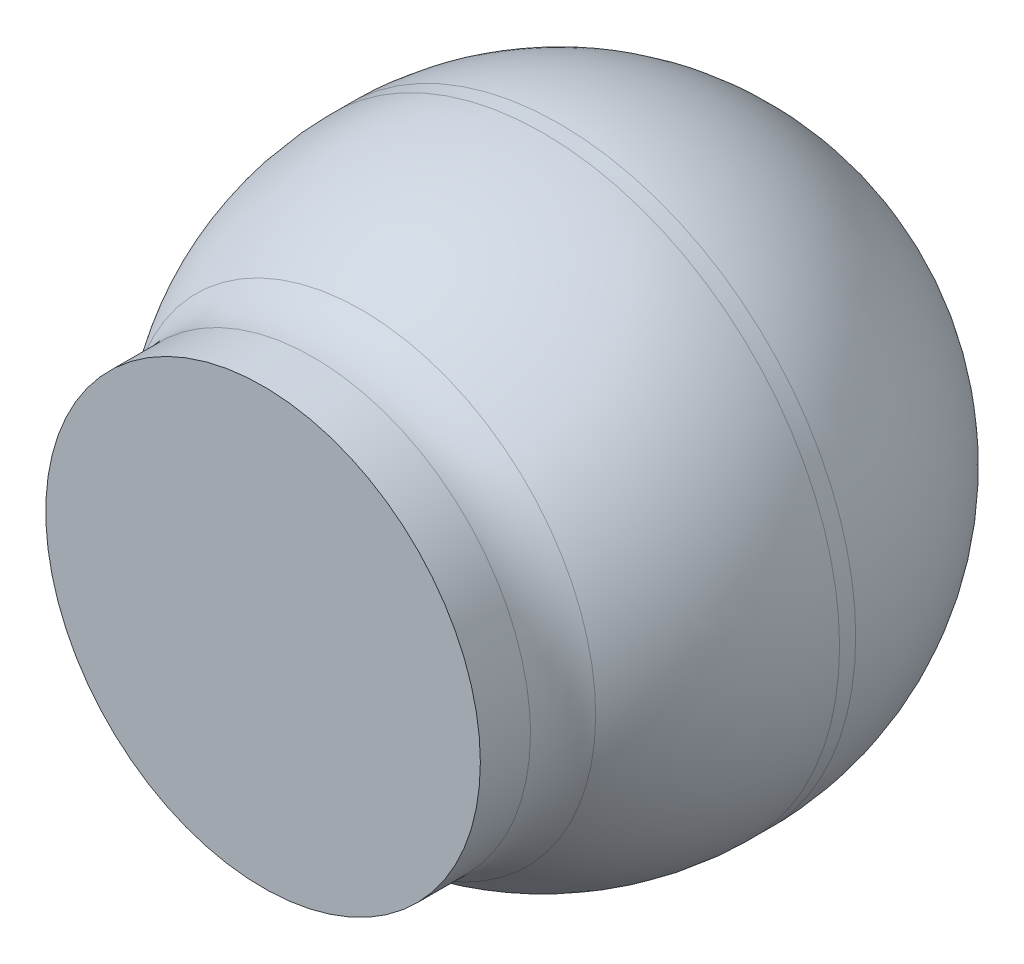
ISO-10303-21;
HEADER;
FILE_DESCRIPTION(('STEP AP214'),'2;1');
FILE_NAME('part.step','',(''),(''),'','','');
FILE_SCHEMA(('AUTOMOTIVE_DESIGN { 1 0 10303 214 1 1 1 1 }'));
ENDSEC;
DATA;
#1=APPLICATION_CONTEXT('core data for automotive mechanical design processes');
#2=APPLICATION_PROTOCOL_DEFINITION('international standard','automotive_design',2000,#1);
#3=PRODUCT_CONTEXT('',#1,'mechanical');
#4=PRODUCT('Part','Part','',(#3));
#5=PRODUCT_RELATED_PRODUCT_CATEGORY('part','',(#4));
#6=PRODUCT_DEFINITION_FORMATION('','',#4);
#7=PRODUCT_DEFINITION_CONTEXT('part definition',#1,'design');
#8=PRODUCT_DEFINITION('design','',#6,#7);
#9=PRODUCT_DEFINITION_SHAPE('','',#8);
#10=(LENGTH_UNIT() NAMED_UNIT(*) SI_UNIT(.MILLI.,.METRE.));
#11=(NAMED_UNIT(*) PLANE_ANGLE_UNIT() SI_UNIT($,.RADIAN.));
#12=(NAMED_UNIT(*) SI_UNIT($,.STERADIAN.) SOLID_ANGLE_UNIT());
#13=UNCERTAINTY_MEASURE_WITH_UNIT(LENGTH_MEASURE(1.E-05),#10,'distance_accuracy_value','');
#14=(GEOMETRIC_REPRESENTATION_CONTEXT(3) GLOBAL_UNCERTAINTY_ASSIGNED_CONTEXT((#13)) GLOBAL_UNIT_ASSIGNED_CONTEXT((#10,
#11,#12)) REPRESENTATION_CONTEXT('',''));
#15=CARTESIAN_POINT('',(0.,0.,0.));
#16=DIRECTION('',(0.,0.,1.));
#17=DIRECTION('',(1.,0.,0.));
#18=AXIS2_PLACEMENT_3D('',#15,#16,#17);
#19=CARTESIAN_POINT('',(-5.642919922269,-5.321349291452,10.006534503384));
#20=DIRECTION('',(0.,0.,-1.));
#21=DIRECTION('',(-1.,0.,0.));
#22=AXIS2_PLACEMENT_3D('',#19,#20,#21);
#23=PLANE('',#22);
#24=CARTESIAN_POINT('',(-5.642919922269,-5.321349291452,10.006534503384));
#25=DIRECTION('',(0.,0.,1.));
#26=DIRECTION('',(1.,0.,0.));
#27=AXIS2_PLACEMENT_3D('',#24,#25,#26);
#28=CIRCLE('',#27,0.275);
#29=CARTESIAN_POINT('',(-5.367919922269,-5.321349291452,10.006534503384));
#30=VERTEX_POINT('',#29);
#31=EDGE_CURVE('E20',#30,#30,#28,.F.);
#32=ORIENTED_EDGE('',*,*,#31,.F.);
#33=EDGE_LOOP('',(#32));
#34=FACE_BOUND('',#33,.T.);
#35=ADVANCED_FACE('F17',(#34),#23,.F.);
#36=CARTESIAN_POINT('',(-5.642919922269,-5.321349291452,9.906534503384));
#37=DIRECTION('',(0.,0.,1.));
#38=DIRECTION('',(1.,0.,0.));
#39=AXIS2_PLACEMENT_3D('',#36,#37,#38);
#40=CYLINDRICAL_SURFACE('',#39,0.275);
#41=CARTESIAN_POINT('',(-5.642919922269,-5.321349291452,9.943180457728));
#42=DIRECTION('',(0.,0.,-1.));
#43=DIRECTION('',(0.996700902337583,0.0811622527992439,0.));
#44=AXIS2_PLACEMENT_3D('',#41,#42,#43);
#45=CIRCLE('',#44,0.275);
#46=CARTESIAN_POINT('',(-5.36882717412616,-5.29902967193221,9.943180457728));
#47=VERTEX_POINT('',#46);
#48=EDGE_CURVE('E65',#47,#47,#45,.F.);
#49=ORIENTED_EDGE('',*,*,#48,.T.);
#50=EDGE_LOOP('',(#49));
#51=FACE_BOUND('',#50,.T.);
#52=ORIENTED_EDGE('',*,*,#31,.T.);
#53=EDGE_LOOP('',(#52));
#54=FACE_BOUND('',#53,.T.);
#55=ADVANCED_FACE('F62',(#51,#54),#40,.T.);
#56=CARTESIAN_POINT('',(-5.642919922269,-5.321349291452,9.943180457728));
#57=DIRECTION('',(0.,0.,-1.));
#58=DIRECTION('',(0.996700902337583,0.0811622527992448,0.));
#59=AXIS2_PLACEMENT_3D('',#56,#57,#58);
#60=TOROIDAL_SURFACE('',#59,0.375,0.1);
#61=ORIENTED_EDGE('',*,*,#48,.F.);
#62=EDGE_LOOP('',(#61));
#63=FACE_BOUND('',#62,.T.);
#64=CARTESIAN_POINT('',(-5.642919922269,-5.321349291452,9.881744931236));
#65=DIRECTION('',(0.,0.,-1.));
#66=DIRECTION('',(-0.996700902337598,-0.081162252799062,0.));
#67=AXIS2_PLACEMENT_3D('',#64,#65,#66);
#68=CIRCLE('',#67,0.296097046412666);
#69=CARTESIAN_POINT('',(-5.938040115608,-5.345381194786,9.881744931236));
#70=VERTEX_POINT('',#69);
#71=EDGE_CURVE('E39',#70,#70,#68,.T.);
#72=ORIENTED_EDGE('',*,*,#71,.F.);
#73=EDGE_LOOP('',(#72));
#74=FACE_BOUND('',#73,.T.);
#75=ADVANCED_FACE('F57',(#63,#74),#60,.F.);
#76=CARTESIAN_POINT('',(-6.016682760645,-5.351785136252,9.651976062157));
#77=CARTESIAN_POINT('',(-6.016682760645,-5.351785136252,9.701461392103));
#78=CARTESIAN_POINT('',(-6.008526217348,-5.351120941579,9.750947004335));
#79=CARTESIAN_POINT('',(-5.992207085349,-5.349792059952,9.798626332798));
#80=CARTESIAN_POINT('',(-5.968341390838,-5.347848654938,9.842699544317));
#81=CARTESIAN_POINT('',(-5.938040115608,-5.345381194786,9.881744931236));
#82=(BOUNDED_CURVE() B_SPLINE_CURVE(5,(#76,#77,#78,#79,#80,#81),.UNSPECIFIED.,.F.,
.F.) B_SPLINE_CURVE_WITH_KNOTS((6,6),(0.,0.661568582165),
.UNSPECIFIED.) CURVE() GEOMETRIC_REPRESENTATION_ITEM() RATIONAL_B_SPLINE_CURVE((1.,1.,1.,1.,1.,1.)) REPRESENTATION_ITEM(''));
#83=CARTESIAN_POINT('',(-5.642919922269,-5.321349291452,9.651976062157));
#84=DIRECTION('',(0.,0.,-1.));
#85=AXIS1_PLACEMENT('',#83,#84);
#86=SURFACE_OF_REVOLUTION('',#82,#85);
#87=CARTESIAN_POINT('',(-5.642919922269,-5.321349291452,9.651976062157));
#88=DIRECTION('',(0.,0.,1.));
#89=DIRECTION('',(1.,0.,0.));
#90=AXIS2_PLACEMENT_3D('',#87,#88,#89);
#91=CIRCLE('',#90,0.375);
#92=CARTESIAN_POINT('',(-5.267919922269,-5.321349291452,9.651976062157));
#93=VERTEX_POINT('',#92);
#94=EDGE_CURVE('E36',#93,#93,#91,.F.);
#95=ORIENTED_EDGE('',*,*,#94,.F.);
#96=EDGE_LOOP('',(#95));
#97=FACE_BOUND('',#96,.T.);
#98=ORIENTED_EDGE('',*,*,#71,.T.);
#99=EDGE_LOOP('',(#98));
#100=FACE_BOUND('',#99,.T.);
#101=ADVANCED_FACE('F53',(#97,#100),#86,.F.);
#102=CARTESIAN_POINT('',(-5.642919922269,-5.321349291452,9.256534503384));
#103=DIRECTION('',(0.,0.,1.));
#104=DIRECTION('',(1.,0.,0.));
#105=AXIS2_PLACEMENT_3D('',#102,#103,#104);
#106=CYLINDRICAL_SURFACE('',#105,0.375);
#107=CARTESIAN_POINT('',(-5.642919922269,-5.321349291452,9.631534503384));
#108=DIRECTION('',(0.,0.,-1.));
#109=DIRECTION('',(0.0811622527992357,-0.996700902337583,0.));
#110=AXIS2_PLACEMENT_3D('',#107,#108,#109);
#111=CIRCLE('',#110,0.375);
#112=CARTESIAN_POINT('',(-5.61248407746929,-5.69511212982859,9.631534503384));
#113=VERTEX_POINT('',#112);
#114=CARTESIAN_POINT('',(-5.67335576706871,-4.94758645307541,9.631534503384));
#115=VERTEX_POINT('',#114);
#116=EDGE_CURVE('E11',#113,#115,#111,.T.);
#117=ORIENTED_EDGE('',*,*,#116,.F.);
#118=CARTESIAN_POINT('',(-5.642919922269,-5.321349291452,9.631534503384));
#119=DIRECTION('',(0.,0.,1.));
#120=DIRECTION('',(0.0811622527992365,-0.996700902337583,0.));
#121=AXIS2_PLACEMENT_3D('',#118,#119,#120);
#122=CIRCLE('',#121,0.375);
#123=EDGE_CURVE('E25',#115,#113,#122,.F.);
#124=ORIENTED_EDGE('',*,*,#123,.F.);
#125=EDGE_LOOP('',(#117,#124));
#126=FACE_BOUND('',#125,.T.);
#127=ORIENTED_EDGE('',*,*,#94,.T.);
#128=EDGE_LOOP('',(#127));
#129=FACE_BOUND('',#128,.T.);
#130=ADVANCED_FACE('F34',(#126,#129),#106,.T.);
#131=CARTESIAN_POINT('',(-5.642919922269,-5.321349291452,9.631534503384));
#132=DIRECTION('',(0.0811622527992361,-0.996700902337583,0.));
#133=DIRECTION('',(-0.996700902337583,-0.0811622527992361,0.));
#134=AXIS2_PLACEMENT_3D('',#131,#132,#133);
#135=SPHERICAL_SURFACE('',#134,0.375);
#136=ORIENTED_EDGE('',*,*,#123,.T.);
#137=ORIENTED_EDGE('',*,*,#116,.T.);
#138=EDGE_LOOP('',(#136,#137));
#139=FACE_BOUND('',#138,.T.);
#140=ADVANCED_FACE('F32',(#139),#135,.T.);
#141=CLOSED_SHELL('',(#35,#55,#75,#101,#130,#140));
#142=MANIFOLD_SOLID_BREP('B1',#141);
#143=ADVANCED_BREP_SHAPE_REPRESENTATION('',(#18,#142),#14);
#144=SHAPE_DEFINITION_REPRESENTATION(#9,#143);
ENDSEC;
END-ISO-10303-21;
